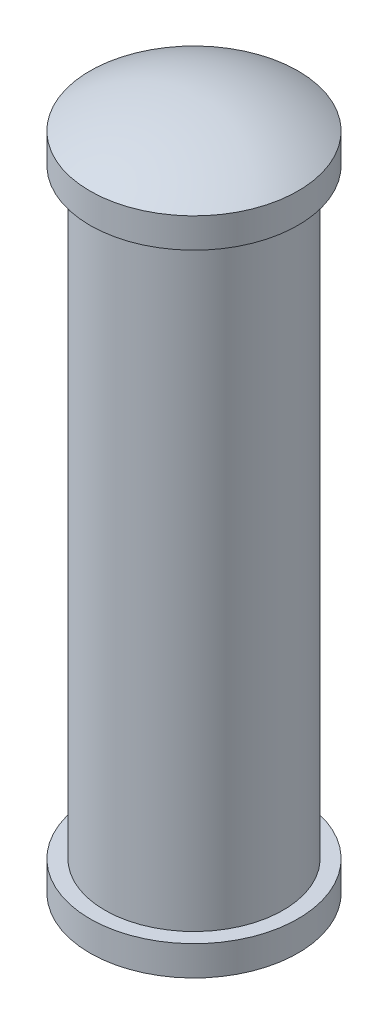
ISO-10303-21;
HEADER;
FILE_DESCRIPTION(('STEP AP214'),'2;1');
FILE_NAME('part.step','',(''),(''),'','','');
FILE_SCHEMA(('AUTOMOTIVE_DESIGN { 1 0 10303 214 1 1 1 1 }'));
ENDSEC;
DATA;
#1=APPLICATION_CONTEXT('core data for automotive mechanical design processes');
#2=APPLICATION_PROTOCOL_DEFINITION('international standard','automotive_design',2000,#1);
#3=PRODUCT_CONTEXT('',#1,'mechanical');
#4=PRODUCT('Part','Part','',(#3));
#5=PRODUCT_RELATED_PRODUCT_CATEGORY('part','',(#4));
#6=PRODUCT_DEFINITION_FORMATION('','',#4);
#7=PRODUCT_DEFINITION_CONTEXT('part definition',#1,'design');
#8=PRODUCT_DEFINITION('design','',#6,#7);
#9=PRODUCT_DEFINITION_SHAPE('','',#8);
#10=(LENGTH_UNIT() NAMED_UNIT(*) SI_UNIT(.MILLI.,.METRE.));
#11=(NAMED_UNIT(*) PLANE_ANGLE_UNIT() SI_UNIT($,.RADIAN.));
#12=(NAMED_UNIT(*) SI_UNIT($,.STERADIAN.) SOLID_ANGLE_UNIT());
#13=UNCERTAINTY_MEASURE_WITH_UNIT(LENGTH_MEASURE(1.E-05),#10,'distance_accuracy_value','');
#14=(GEOMETRIC_REPRESENTATION_CONTEXT(3) GLOBAL_UNCERTAINTY_ASSIGNED_CONTEXT((#13)) GLOBAL_UNIT_ASSIGNED_CONTEXT((#10,
#11,#12)) REPRESENTATION_CONTEXT('',''));
#15=CARTESIAN_POINT('',(0.,0.,0.));
#16=DIRECTION('',(0.,0.,1.));
#17=DIRECTION('',(1.,0.,0.));
#18=AXIS2_PLACEMENT_3D('',#15,#16,#17);
#19=CARTESIAN_POINT('',(0.,5.95081967213115,0.));
#20=DIRECTION('',(0.,1.,0.));
#21=DIRECTION('',(0.,0.,1.));
#22=AXIS2_PLACEMENT_3D('',#19,#20,#21);
#23=CYLINDRICAL_SURFACE('',#22,3.);
#24=CARTESIAN_POINT('',(0.,10.1,0.));
#25=DIRECTION('',(0.,1.,0.));
#26=DIRECTION('',(0.,0.,1.));
#27=AXIS2_PLACEMENT_3D('',#24,#25,#26);
#28=CIRCLE('',#27,3.);
#29=CARTESIAN_POINT('',(0.,10.1,3.));
#30=VERTEX_POINT('',#29);
#31=EDGE_CURVE('E10',#30,#30,#28,.T.);
#32=ORIENTED_EDGE('',*,*,#31,.F.);
#33=EDGE_LOOP('',(#32));
#34=FACE_BOUND('',#33,.T.);
#35=CARTESIAN_POINT('',(0.,-10.1,0.));
#36=DIRECTION('',(0.,1.,0.));
#37=DIRECTION('',(0.,0.,1.));
#38=AXIS2_PLACEMENT_3D('',#35,#36,#37);
#39=CIRCLE('',#38,3.);
#40=CARTESIAN_POINT('',(0.,-10.1,3.));
#41=VERTEX_POINT('',#40);
#42=EDGE_CURVE('E55',#41,#41,#39,.T.);
#43=ORIENTED_EDGE('',*,*,#42,.T.);
#44=EDGE_LOOP('',(#43));
#45=FACE_BOUND('',#44,.T.);
#46=ADVANCED_FACE('F37',(#34,#45),#23,.T.);
#47=CARTESIAN_POINT('',(0.,11.1,0.));
#48=DIRECTION('',(0.,-1.,0.));
#49=DIRECTION('',(0.,0.,-1.));
#50=AXIS2_PLACEMENT_3D('',#47,#48,#49);
#51=CYLINDRICAL_SURFACE('',#50,3.5);
#52=CARTESIAN_POINT('',(0.,11.1,0.));
#53=DIRECTION('',(0.,1.,0.));
#54=DIRECTION('',(0.,0.,1.));
#55=AXIS2_PLACEMENT_3D('',#52,#53,#54);
#56=CIRCLE('',#55,3.5);
#57=CARTESIAN_POINT('',(0.,11.1,3.5));
#58=VERTEX_POINT('',#57);
#59=EDGE_CURVE('E41',#58,#58,#56,.T.);
#60=ORIENTED_EDGE('',*,*,#59,.F.);
#61=EDGE_LOOP('',(#60));
#62=FACE_BOUND('',#61,.T.);
#63=CARTESIAN_POINT('',(0.,10.1,0.));
#64=DIRECTION('',(0.,1.,0.));
#65=DIRECTION('',(0.,0.,1.));
#66=AXIS2_PLACEMENT_3D('',#63,#64,#65);
#67=CIRCLE('',#66,3.5);
#68=CARTESIAN_POINT('',(0.,10.1,3.5));
#69=VERTEX_POINT('',#68);
#70=EDGE_CURVE('E50',#69,#69,#67,.T.);
#71=ORIENTED_EDGE('',*,*,#70,.T.);
#72=EDGE_LOOP('',(#71));
#73=FACE_BOUND('',#72,.T.);
#74=ADVANCED_FACE('F85',(#62,#73),#51,.T.);
#75=CARTESIAN_POINT('',(0.,5.475,0.));
#76=DIRECTION('',(0.,0.,1.));
#77=DIRECTION('',(1.,0.,0.));
#78=AXIS2_PLACEMENT_3D('',#75,#76,#77);
#79=SPHERICAL_SURFACE('',#78,6.625);
#80=CARTESIAN_POINT('',(0.,5.475,0.));
#81=DIRECTION('',(0.,1.,0.));
#82=DIRECTION('',(0.,0.,1.));
#83=AXIS2_PLACEMENT_3D('',#80,#81,#82);
#84=SPHERICAL_SURFACE('',#83,6.625);
#85=ORIENTED_EDGE('',*,*,#59,.T.);
#86=EDGE_LOOP('',(#85));
#87=FACE_BOUND('',#86,.T.);
#88=ADVANCED_FACE('F39',(#87),#84,.T.);
#89=CARTESIAN_POINT('',(0.,10.1,0.));
#90=DIRECTION('',(0.,1.,0.));
#91=DIRECTION('',(0.,0.,1.));
#92=AXIS2_PLACEMENT_3D('',#89,#90,#91);
#93=PLANE('',#92);
#94=ORIENTED_EDGE('',*,*,#31,.T.);
#95=EDGE_LOOP('',(#94));
#96=FACE_BOUND('',#95,.T.);
#97=ORIENTED_EDGE('',*,*,#70,.F.);
#98=EDGE_LOOP('',(#97));
#99=FACE_BOUND('',#98,.T.);
#100=ADVANCED_FACE('F73',(#96,#99),#93,.F.);
#101=CARTESIAN_POINT('',(0.,-11.1,0.));
#102=DIRECTION('',(0.,1.,0.));
#103=DIRECTION('',(0.,0.,-1.));
#104=AXIS2_PLACEMENT_3D('',#101,#102,#103);
#105=CYLINDRICAL_SURFACE('',#104,3.5);
#106=CARTESIAN_POINT('',(0.,-11.1,0.));
#107=DIRECTION('',(0.,1.,0.));
#108=DIRECTION('',(0.,0.,1.));
#109=AXIS2_PLACEMENT_3D('',#106,#107,#108);
#110=CIRCLE('',#109,3.5);
#111=CARTESIAN_POINT('',(0.,-11.1,3.5));
#112=VERTEX_POINT('',#111);
#113=EDGE_CURVE('E56',#112,#112,#110,.T.);
#114=ORIENTED_EDGE('',*,*,#113,.T.);
#115=EDGE_LOOP('',(#114));
#116=FACE_BOUND('',#115,.T.);
#117=CARTESIAN_POINT('',(0.,-10.1,0.));
#118=DIRECTION('',(0.,1.,0.));
#119=DIRECTION('',(0.,0.,1.));
#120=AXIS2_PLACEMENT_3D('',#117,#118,#119);
#121=CIRCLE('',#120,3.5);
#122=CARTESIAN_POINT('',(0.,-10.1,3.5));
#123=VERTEX_POINT('',#122);
#124=EDGE_CURVE('E60',#123,#123,#121,.T.);
#125=ORIENTED_EDGE('',*,*,#124,.F.);
#126=EDGE_LOOP('',(#125));
#127=FACE_BOUND('',#126,.T.);
#128=ADVANCED_FACE('F70',(#116,#127),#105,.T.);
#129=CARTESIAN_POINT('',(0.,-5.475,0.));
#130=DIRECTION('',(0.,0.,1.));
#131=DIRECTION('',(1.,0.,0.));
#132=AXIS2_PLACEMENT_3D('',#129,#130,#131);
#133=SPHERICAL_SURFACE('',#132,6.625);
#134=CARTESIAN_POINT('',(0.,-5.475,0.));
#135=DIRECTION('',(0.,1.,0.));
#136=DIRECTION('',(0.,0.,1.));
#137=AXIS2_PLACEMENT_3D('',#134,#135,#136);
#138=SPHERICAL_SURFACE('',#137,6.625);
#139=ORIENTED_EDGE('',*,*,#113,.F.);
#140=EDGE_LOOP('',(#139));
#141=FACE_BOUND('',#140,.T.);
#142=ADVANCED_FACE('F72',(#141),#138,.T.);
#143=CARTESIAN_POINT('',(0.,-10.1,0.));
#144=DIRECTION('',(0.,-1.,0.));
#145=DIRECTION('',(0.,0.,1.));
#146=AXIS2_PLACEMENT_3D('',#143,#144,#145);
#147=PLANE('',#146);
#148=ORIENTED_EDGE('',*,*,#42,.F.);
#149=EDGE_LOOP('',(#148));
#150=FACE_BOUND('',#149,.T.);
#151=ORIENTED_EDGE('',*,*,#124,.T.);
#152=EDGE_LOOP('',(#151));
#153=FACE_BOUND('',#152,.T.);
#154=ADVANCED_FACE('F68',(#150,#153),#147,.F.);
#155=CLOSED_SHELL('',(#46,#74,#88,#100,#128,#142,#154));
#156=MANIFOLD_SOLID_BREP('B2',#155);
#157=ADVANCED_BREP_SHAPE_REPRESENTATION('',(#18,#156),#14);
#158=SHAPE_DEFINITION_REPRESENTATION(#9,#157);
ENDSEC;
END-ISO-10303-21;
